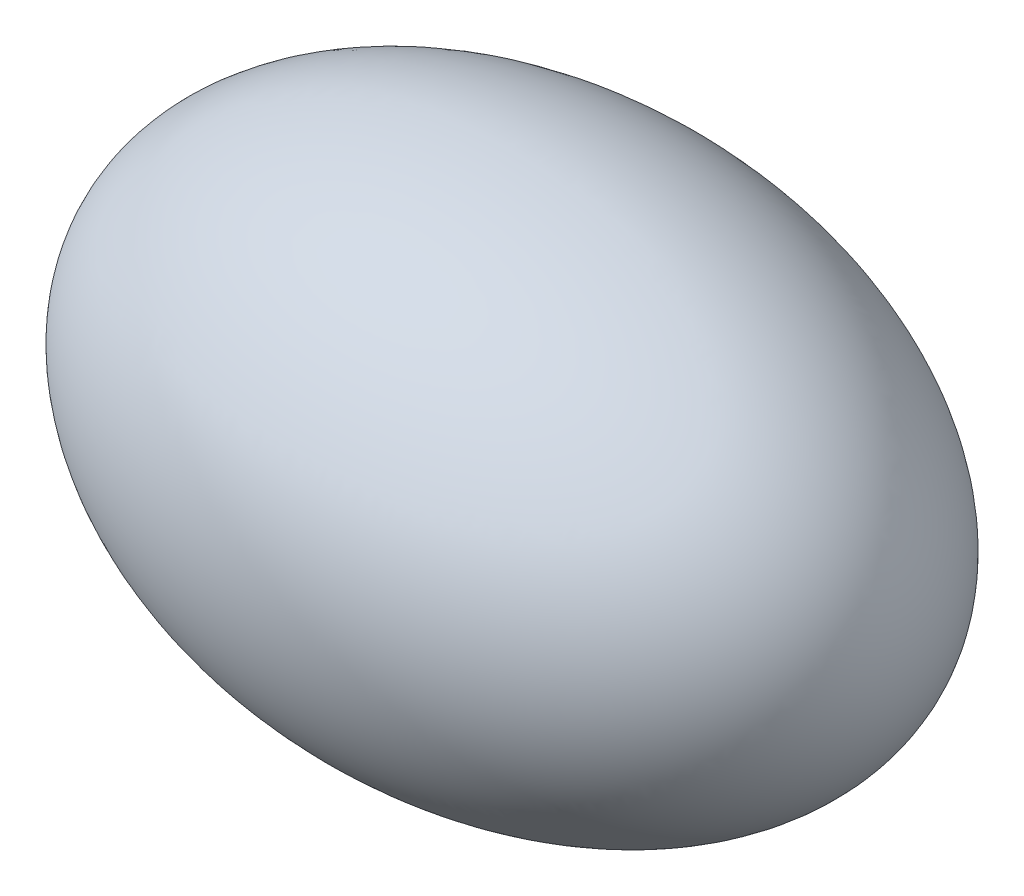
ISO-10303-21;
HEADER;
FILE_DESCRIPTION(('STEP AP214'),'2;1');
FILE_NAME('part.step','',(''),(''),'','','');
FILE_SCHEMA(('AUTOMOTIVE_DESIGN { 1 0 10303 214 1 1 1 1 }'));
ENDSEC;
DATA;
#1=APPLICATION_CONTEXT('core data for automotive mechanical design processes');
#2=APPLICATION_PROTOCOL_DEFINITION('international standard','automotive_design',2000,#1);
#3=PRODUCT_CONTEXT('',#1,'mechanical');
#4=PRODUCT('Part','Part','',(#3));
#5=PRODUCT_RELATED_PRODUCT_CATEGORY('part','',(#4));
#6=PRODUCT_DEFINITION_FORMATION('','',#4);
#7=PRODUCT_DEFINITION_CONTEXT('part definition',#1,'design');
#8=PRODUCT_DEFINITION('design','',#6,#7);
#9=PRODUCT_DEFINITION_SHAPE('','',#8);
#10=(LENGTH_UNIT() NAMED_UNIT(*) SI_UNIT(.MILLI.,.METRE.));
#11=(NAMED_UNIT(*) PLANE_ANGLE_UNIT() SI_UNIT($,.RADIAN.));
#12=(NAMED_UNIT(*) SI_UNIT($,.STERADIAN.) SOLID_ANGLE_UNIT());
#13=UNCERTAINTY_MEASURE_WITH_UNIT(LENGTH_MEASURE(1.E-05),#10,'distance_accuracy_value','');
#14=(GEOMETRIC_REPRESENTATION_CONTEXT(3) GLOBAL_UNCERTAINTY_ASSIGNED_CONTEXT((#13)) GLOBAL_UNIT_ASSIGNED_CONTEXT((#10,
#11,#12)) REPRESENTATION_CONTEXT('',''));
#15=CARTESIAN_POINT('',(0.,0.,0.));
#16=DIRECTION('',(0.,0.,1.));
#17=DIRECTION('',(1.,0.,0.));
#18=AXIS2_PLACEMENT_3D('',#15,#16,#17);
#19=CARTESIAN_POINT('',(-64.6818109004537,0.,7.98767013865083));
#20=DIRECTION('',(0.,1.,0.));
#21=DIRECTION('',(-1.,0.,0.));
#22=AXIS2_PLACEMENT_3D('',#19,#20,#21);
#23=ELLIPSE('',#22,750.,500.);
#24=TRIMMED_CURVE('',#23,(PARAMETER_VALUE(3.14159265358979)),
(PARAMETER_VALUE(6.28318530717959)),.T.,.PARAMETER.);
#25=CARTESIAN_POINT('',(-814.681810900454,0.,7.98767013865092));
#26=DIRECTION('',(-1.,0.,0.));
#27=AXIS1_PLACEMENT('',#25,#26);
#28=SURFACE_OF_REVOLUTION('',#24,#27);
#29=CARTESIAN_POINT('',(-814.681810900454,0.,7.98767013865092));
#30=VERTEX_POINT('',#29);
#31=VERTEX_LOOP('',#30);
#32=FACE_BOUND('',#31,.T.);
#33=CARTESIAN_POINT('',(685.318189099546,0.,7.98767013865074));
#34=VERTEX_POINT('',#33);
#35=VERTEX_LOOP('',#34);
#36=FACE_BOUND('',#35,.T.);
#37=ADVANCED_FACE('F40',(#32,#36),#28,.T.);
#38=CLOSED_SHELL('',(#37));
#39=MANIFOLD_SOLID_BREP('B2',#38);
#40=ADVANCED_BREP_SHAPE_REPRESENTATION('',(#18,#39),#14);
#41=SHAPE_DEFINITION_REPRESENTATION(#9,#40);
ENDSEC;
END-ISO-10303-21;
